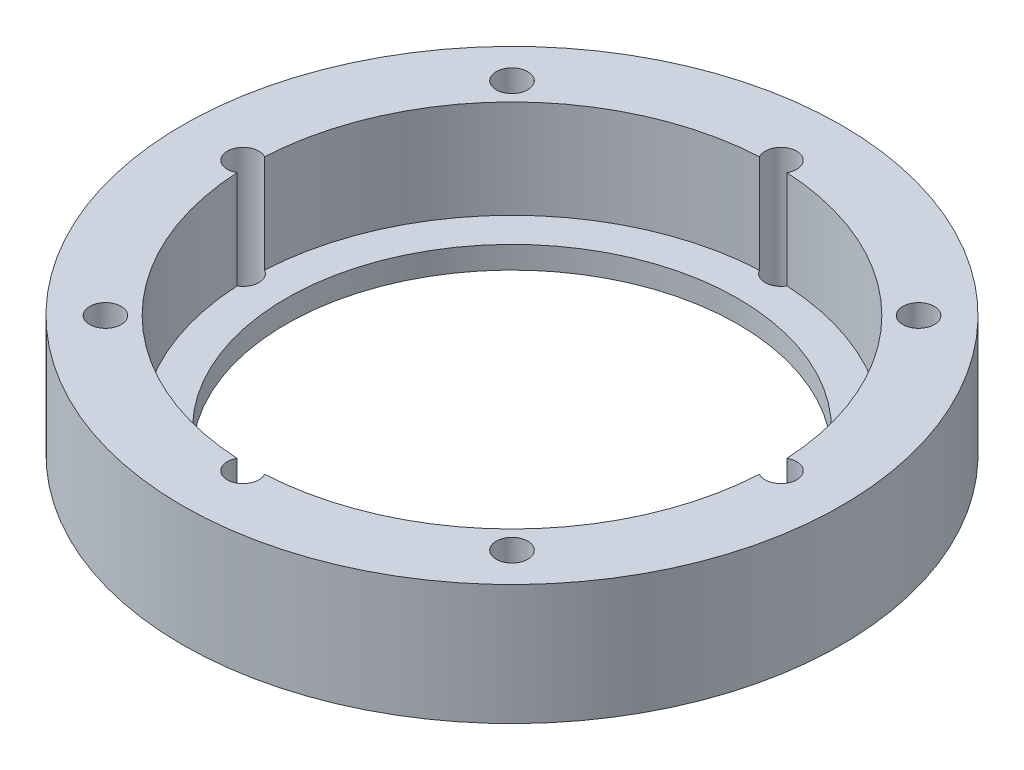
ISO-10303-21;
HEADER;
FILE_DESCRIPTION(('STEP AP214'),'2;1');
FILE_NAME('part.step','',(''),(''),'','','');
FILE_SCHEMA(('AUTOMOTIVE_DESIGN { 1 0 10303 214 1 1 1 1 }'));
ENDSEC;
DATA;
#1=APPLICATION_CONTEXT('core data for automotive mechanical design processes');
#2=APPLICATION_PROTOCOL_DEFINITION('international standard','automotive_design',2000,#1);
#3=PRODUCT_CONTEXT('',#1,'mechanical');
#4=PRODUCT('Part','Part','',(#3));
#5=PRODUCT_RELATED_PRODUCT_CATEGORY('part','',(#4));
#6=PRODUCT_DEFINITION_FORMATION('','',#4);
#7=PRODUCT_DEFINITION_CONTEXT('part definition',#1,'design');
#8=PRODUCT_DEFINITION('design','',#6,#7);
#9=PRODUCT_DEFINITION_SHAPE('','',#8);
#10=(LENGTH_UNIT() NAMED_UNIT(*) SI_UNIT(.MILLI.,.METRE.));
#11=(NAMED_UNIT(*) PLANE_ANGLE_UNIT() SI_UNIT($,.RADIAN.));
#12=(NAMED_UNIT(*) SI_UNIT($,.STERADIAN.) SOLID_ANGLE_UNIT());
#13=UNCERTAINTY_MEASURE_WITH_UNIT(LENGTH_MEASURE(1.E-05),#10,'distance_accuracy_value','');
#14=(GEOMETRIC_REPRESENTATION_CONTEXT(3) GLOBAL_UNCERTAINTY_ASSIGNED_CONTEXT((#13)) GLOBAL_UNIT_ASSIGNED_CONTEXT((#10,
#11,#12)) REPRESENTATION_CONTEXT('',''));
#15=CARTESIAN_POINT('',(0.,0.,0.));
#16=DIRECTION('',(0.,0.,1.));
#17=DIRECTION('',(1.,0.,0.));
#18=AXIS2_PLACEMENT_3D('',#15,#16,#17);
#19=CARTESIAN_POINT('',(0.,0.,0.));
#20=DIRECTION('',(0.,-1.,0.));
#21=DIRECTION('',(0.,0.,-1.));
#22=AXIS2_PLACEMENT_3D('',#19,#20,#21);
#23=CYLINDRICAL_SURFACE('',#22,18.65);
#24=CARTESIAN_POINT('',(0.,8.5875,0.));
#25=DIRECTION('',(0.,-1.,0.));
#26=DIRECTION('',(0.,0.,-1.));
#27=AXIS2_PLACEMENT_3D('',#24,#25,#26);
#28=CIRCLE('',#27,18.65);
#29=CARTESIAN_POINT('',(0.979838942086625,8.5875,-18.6242426865516));
#30=VERTEX_POINT('',#29);
#31=CARTESIAN_POINT('',(18.6242426865516,8.5875,-0.97983894208656));
#32=VERTEX_POINT('',#31);
#33=EDGE_CURVE('E124',#30,#32,#28,.T.);
#34=ORIENTED_EDGE('',*,*,#33,.F.);
#35=DIRECTION('',(0.,-1.,0.));
#36=VECTOR('',#35,1.);
#37=CARTESIAN_POINT('',(0.979838942086616,4.29375,-18.6242426865516));
#38=LINE('',#37,#36);
#39=CARTESIAN_POINT('',(0.97983894208658,1.5875,-18.6242426865516));
#40=VERTEX_POINT('',#39);
#41=EDGE_CURVE('E138',#30,#40,#38,.T.);
#42=ORIENTED_EDGE('',*,*,#41,.T.);
#43=CARTESIAN_POINT('',(0.,1.5875,0.));
#44=DIRECTION('',(0.,-1.,0.));
#45=DIRECTION('',(0.,0.,-1.));
#46=AXIS2_PLACEMENT_3D('',#43,#44,#45);
#47=CIRCLE('',#46,18.65);
#48=CARTESIAN_POINT('',(18.6242426865516,1.5875,-0.979838942086515));
#49=VERTEX_POINT('',#48);
#50=EDGE_CURVE('E126',#40,#49,#47,.T.);
#51=ORIENTED_EDGE('',*,*,#50,.T.);
#52=DIRECTION('',(0.,-1.,0.));
#53=VECTOR('',#52,1.);
#54=CARTESIAN_POINT('',(18.6242426865516,4.29375,-0.97983894208655));
#55=LINE('',#54,#53);
#56=EDGE_CURVE('E56',#49,#32,#55,.F.);
#57=ORIENTED_EDGE('',*,*,#56,.T.);
#58=EDGE_LOOP('',(#34,#42,#51,#57));
#59=FACE_BOUND('',#58,.T.);
#60=ADVANCED_FACE('F33',(#59),#23,.F.);
#61=CARTESIAN_POINT('',(18.6242426865516,8.5875,0.97983894208656));
#62=VERTEX_POINT('',#61);
#63=CARTESIAN_POINT('',(0.979838942086365,8.5875,18.6242426865516));
#64=VERTEX_POINT('',#63);
#65=EDGE_CURVE('E115',#62,#64,#28,.T.);
#66=ORIENTED_EDGE('',*,*,#65,.F.);
#67=DIRECTION('',(0.,-1.,0.));
#68=VECTOR('',#67,1.);
#69=CARTESIAN_POINT('',(18.6242426865516,4.29375,0.979838942086549));
#70=LINE('',#69,#68);
#71=CARTESIAN_POINT('',(18.6242426865516,1.5875,0.979838942086515));
#72=VERTEX_POINT('',#71);
#73=EDGE_CURVE('E140',#62,#72,#70,.T.);
#74=ORIENTED_EDGE('',*,*,#73,.T.);
#75=CARTESIAN_POINT('',(0.97983894208632,1.5875,18.6242426865516));
#76=VERTEX_POINT('',#75);
#77=EDGE_CURVE('E181',#72,#76,#47,.T.);
#78=ORIENTED_EDGE('',*,*,#77,.T.);
#79=DIRECTION('',(0.,-1.,0.));
#80=VECTOR('',#79,1.);
#81=CARTESIAN_POINT('',(0.979838942086355,4.29375,18.6242426865516));
#82=LINE('',#81,#80);
#83=EDGE_CURVE('E48',#76,#64,#82,.F.);
#84=ORIENTED_EDGE('',*,*,#83,.T.);
#85=EDGE_LOOP('',(#66,#74,#78,#84));
#86=FACE_BOUND('',#85,.T.);
#87=ADVANCED_FACE('F185',(#86),#23,.F.);
#88=CARTESIAN_POINT('',(-0.979838942086755,8.5875,18.6242426865516));
#89=VERTEX_POINT('',#88);
#90=CARTESIAN_POINT('',(-18.6242426865516,8.5875,0.97983894208656));
#91=VERTEX_POINT('',#90);
#92=EDGE_CURVE('E111',#89,#91,#28,.T.);
#93=ORIENTED_EDGE('',*,*,#92,.F.);
#94=DIRECTION('',(0.,-1.,0.));
#95=VECTOR('',#94,1.);
#96=CARTESIAN_POINT('',(-0.979838942086745,4.29375,18.6242426865516));
#97=LINE('',#96,#95);
#98=CARTESIAN_POINT('',(-0.97983894208671,1.5875,18.6242426865516));
#99=VERTEX_POINT('',#98);
#100=EDGE_CURVE('E96',#89,#99,#97,.T.);
#101=ORIENTED_EDGE('',*,*,#100,.T.);
#102=CARTESIAN_POINT('',(-18.6242426865516,1.5875,0.979838942086515));
#103=VERTEX_POINT('',#102);
#104=EDGE_CURVE('E128',#99,#103,#47,.T.);
#105=ORIENTED_EDGE('',*,*,#104,.T.);
#106=DIRECTION('',(0.,-1.,0.));
#107=VECTOR('',#106,1.);
#108=CARTESIAN_POINT('',(-18.6242426865516,4.29375,0.97983894208655));
#109=LINE('',#108,#107);
#110=EDGE_CURVE('E122',#103,#91,#109,.F.);
#111=ORIENTED_EDGE('',*,*,#110,.T.);
#112=EDGE_LOOP('',(#93,#101,#105,#111));
#113=FACE_BOUND('',#112,.T.);
#114=ADVANCED_FACE('F120',(#113),#23,.F.);
#115=CARTESIAN_POINT('',(0.,0.,0.));
#116=DIRECTION('',(0.,-1.,0.));
#117=DIRECTION('',(0.,0.,-1.));
#118=AXIS2_PLACEMENT_3D('',#115,#116,#117);
#119=CYLINDRICAL_SURFACE('',#118,23.5);
#120=CARTESIAN_POINT('',(0.,0.,0.));
#121=DIRECTION('',(0.,-1.,0.));
#122=DIRECTION('',(0.,0.,-1.));
#123=AXIS2_PLACEMENT_3D('',#120,#121,#122);
#124=CIRCLE('',#123,23.5);
#125=CARTESIAN_POINT('',(0.,0.,-23.5));
#126=VERTEX_POINT('',#125);
#127=EDGE_CURVE('E171',#126,#126,#124,.T.);
#128=ORIENTED_EDGE('',*,*,#127,.F.);
#129=EDGE_LOOP('',(#128));
#130=FACE_BOUND('',#129,.T.);
#131=CARTESIAN_POINT('',(0.,8.5875,0.));
#132=DIRECTION('',(0.,-1.,0.));
#133=DIRECTION('',(0.,0.,-1.));
#134=AXIS2_PLACEMENT_3D('',#131,#132,#133);
#135=CIRCLE('',#134,23.5);
#136=CARTESIAN_POINT('',(0.,8.5875,-23.5));
#137=VERTEX_POINT('',#136);
#138=EDGE_CURVE('E11',#137,#137,#135,.T.);
#139=ORIENTED_EDGE('',*,*,#138,.T.);
#140=EDGE_LOOP('',(#139));
#141=FACE_BOUND('',#140,.T.);
#142=ADVANCED_FACE('F35',(#130,#141),#119,.T.);
#143=CARTESIAN_POINT('',(-23.5,8.5875,0.));
#144=DIRECTION('',(0.,-1.,0.));
#145=DIRECTION('',(0.,0.,-1.));
#146=AXIS2_PLACEMENT_3D('',#143,#144,#145);
#147=PLANE('',#146);
#148=CARTESIAN_POINT('',(-14.4956890291734,8.5875,-14.4956890291735));
#149=DIRECTION('',(0.,-1.,0.));
#150=DIRECTION('',(1.,0.,0.));
#151=AXIS2_PLACEMENT_3D('',#148,#149,#150);
#152=CIRCLE('',#151,1.125);
#153=CARTESIAN_POINT('',(-13.3706890291734,8.5875,-14.4956890291735));
#154=VERTEX_POINT('',#153);
#155=EDGE_CURVE('E194',#154,#154,#152,.T.);
#156=ORIENTED_EDGE('',*,*,#155,.T.);
#157=EDGE_LOOP('',(#156));
#158=FACE_BOUND('',#157,.T.);
#159=CARTESIAN_POINT('',(14.4956890291735,8.5875,-14.4956890291735));
#160=DIRECTION('',(0.,-1.,0.));
#161=DIRECTION('',(0.,0.,1.));
#162=AXIS2_PLACEMENT_3D('',#159,#160,#161);
#163=CIRCLE('',#162,1.125);
#164=CARTESIAN_POINT('',(14.4956890291735,8.5875,-13.3706890291735));
#165=VERTEX_POINT('',#164);
#166=EDGE_CURVE('E210',#165,#165,#163,.T.);
#167=ORIENTED_EDGE('',*,*,#166,.T.);
#168=EDGE_LOOP('',(#167));
#169=FACE_BOUND('',#168,.T.);
#170=CARTESIAN_POINT('',(14.4956890291733,8.5875,14.4956890291736));
#171=DIRECTION('',(0.,-1.,0.));
#172=DIRECTION('',(-1.,0.,0.));
#173=AXIS2_PLACEMENT_3D('',#170,#171,#172);
#174=CIRCLE('',#173,1.125);
#175=CARTESIAN_POINT('',(13.3706890291733,8.5875,14.4956890291736));
#176=VERTEX_POINT('',#175);
#177=EDGE_CURVE('E204',#176,#176,#174,.T.);
#178=ORIENTED_EDGE('',*,*,#177,.T.);
#179=EDGE_LOOP('',(#178));
#180=FACE_BOUND('',#179,.T.);
#181=CARTESIAN_POINT('',(-14.4956890291735,8.5875,14.4956890291735));
#182=DIRECTION('',(0.,-1.,0.));
#183=DIRECTION('',(0.,0.,-1.));
#184=AXIS2_PLACEMENT_3D('',#181,#182,#183);
#185=CIRCLE('',#184,1.125);
#186=CARTESIAN_POINT('',(-14.4956890291735,8.5875,13.3706890291735));
#187=VERTEX_POINT('',#186);
#188=EDGE_CURVE('E154',#187,#187,#185,.T.);
#189=ORIENTED_EDGE('',*,*,#188,.T.);
#190=EDGE_LOOP('',(#189));
#191=FACE_BOUND('',#190,.T.);
#192=ORIENTED_EDGE('',*,*,#138,.F.);
#193=EDGE_LOOP('',(#192));
#194=FACE_BOUND('',#193,.T.);
#195=CARTESIAN_POINT('',(-18.6242426865516,8.5875,-0.97983894208656));
#196=VERTEX_POINT('',#195);
#197=CARTESIAN_POINT('',(-0.979838942086495,8.5875,-18.6242426865516));
#198=VERTEX_POINT('',#197);
#199=EDGE_CURVE('E41',#196,#198,#28,.T.);
#200=ORIENTED_EDGE('',*,*,#199,.T.);
#201=CARTESIAN_POINT('',(0.,8.5875,-19.177));
#202=DIRECTION('',(0.,-1.,0.));
#203=DIRECTION('',(1.,0.,0.));
#204=AXIS2_PLACEMENT_3D('',#201,#202,#203);
#205=CIRCLE('',#204,1.125);
#206=EDGE_CURVE('E134',#198,#30,#205,.T.);
#207=ORIENTED_EDGE('',*,*,#206,.T.);
#208=ORIENTED_EDGE('',*,*,#33,.T.);
#209=CARTESIAN_POINT('',(19.177,8.5875,0.));
#210=DIRECTION('',(0.,-1.,0.));
#211=DIRECTION('',(0.,0.,1.));
#212=AXIS2_PLACEMENT_3D('',#209,#210,#211);
#213=CIRCLE('',#212,1.125);
#214=EDGE_CURVE('E133',#32,#62,#213,.T.);
#215=ORIENTED_EDGE('',*,*,#214,.T.);
#216=ORIENTED_EDGE('',*,*,#65,.T.);
#217=CARTESIAN_POINT('',(-2.00749121284926E-13,8.5875,19.177));
#218=DIRECTION('',(0.,-1.,0.));
#219=DIRECTION('',(-1.,0.,0.));
#220=AXIS2_PLACEMENT_3D('',#217,#218,#219);
#221=CIRCLE('',#220,1.125);
#222=EDGE_CURVE('E99',#64,#89,#221,.T.);
#223=ORIENTED_EDGE('',*,*,#222,.T.);
#224=ORIENTED_EDGE('',*,*,#92,.T.);
#225=CARTESIAN_POINT('',(-19.177,8.5875,0.));
#226=DIRECTION('',(0.,-1.,0.));
#227=DIRECTION('',(0.,0.,-1.));
#228=AXIS2_PLACEMENT_3D('',#225,#226,#227);
#229=CIRCLE('',#228,1.125);
#230=EDGE_CURVE('E160',#91,#196,#229,.T.);
#231=ORIENTED_EDGE('',*,*,#230,.T.);
#232=EDGE_LOOP('',(#200,#207,#208,#215,#216,#223,#224,#231));
#233=FACE_BOUND('',#232,.T.);
#234=ADVANCED_FACE('F109',(#158,#169,#180,#191,#194,#233),#147,.F.);
#235=CARTESIAN_POINT('',(-18.6242426865516,1.5875,-0.979838942086515));
#236=VERTEX_POINT('',#235);
#237=CARTESIAN_POINT('',(-0.97983894208645,1.5875,-18.6242426865516));
#238=VERTEX_POINT('',#237);
#239=EDGE_CURVE('E123',#236,#238,#47,.T.);
#240=ORIENTED_EDGE('',*,*,#239,.T.);
#241=DIRECTION('',(0.,-1.,0.));
#242=VECTOR('',#241,1.);
#243=CARTESIAN_POINT('',(-0.979838942086485,4.29375,-18.6242426865516));
#244=LINE('',#243,#242);
#245=EDGE_CURVE('E149',#238,#198,#244,.F.);
#246=ORIENTED_EDGE('',*,*,#245,.T.);
#247=ORIENTED_EDGE('',*,*,#199,.F.);
#248=DIRECTION('',(0.,-1.,0.));
#249=VECTOR('',#248,1.);
#250=CARTESIAN_POINT('',(-18.6242426865516,4.29375,-0.979838942086549));
#251=LINE('',#250,#249);
#252=EDGE_CURVE('E168',#196,#236,#251,.T.);
#253=ORIENTED_EDGE('',*,*,#252,.T.);
#254=EDGE_LOOP('',(#240,#246,#247,#253));
#255=FACE_BOUND('',#254,.T.);
#256=ADVANCED_FACE('F257',(#255),#23,.F.);
#257=CARTESIAN_POINT('',(-18.65,1.5875,0.));
#258=DIRECTION('',(0.,-1.,0.));
#259=DIRECTION('',(0.,0.,-1.));
#260=AXIS2_PLACEMENT_3D('',#257,#258,#259);
#261=PLANE('',#260);
#262=ORIENTED_EDGE('',*,*,#50,.F.);
#263=CARTESIAN_POINT('',(0.,1.5875,-19.177));
#264=DIRECTION('',(0.,-1.,0.));
#265=DIRECTION('',(0.,0.,-1.));
#266=AXIS2_PLACEMENT_3D('',#263,#264,#265);
#267=CIRCLE('',#266,1.125);
#268=EDGE_CURVE('E143',#40,#238,#267,.T.);
#269=ORIENTED_EDGE('',*,*,#268,.T.);
#270=ORIENTED_EDGE('',*,*,#239,.F.);
#271=CARTESIAN_POINT('',(-19.177,1.5875,0.));
#272=DIRECTION('',(0.,-1.,0.));
#273=DIRECTION('',(0.,0.,-1.));
#274=AXIS2_PLACEMENT_3D('',#271,#272,#273);
#275=CIRCLE('',#274,1.125);
#276=EDGE_CURVE('E162',#236,#103,#275,.T.);
#277=ORIENTED_EDGE('',*,*,#276,.T.);
#278=ORIENTED_EDGE('',*,*,#104,.F.);
#279=CARTESIAN_POINT('',(-2.00749121284926E-13,1.5875,19.177));
#280=DIRECTION('',(0.,-1.,0.));
#281=DIRECTION('',(0.,0.,-1.));
#282=AXIS2_PLACEMENT_3D('',#279,#280,#281);
#283=CIRCLE('',#282,1.125);
#284=EDGE_CURVE('E100',#99,#76,#283,.T.);
#285=ORIENTED_EDGE('',*,*,#284,.T.);
#286=ORIENTED_EDGE('',*,*,#77,.F.);
#287=CARTESIAN_POINT('',(19.177,1.5875,0.));
#288=DIRECTION('',(0.,-1.,0.));
#289=DIRECTION('',(0.,0.,-1.));
#290=AXIS2_PLACEMENT_3D('',#287,#288,#289);
#291=CIRCLE('',#290,1.125);
#292=EDGE_CURVE('E104',#72,#49,#291,.T.);
#293=ORIENTED_EDGE('',*,*,#292,.T.);
#294=EDGE_LOOP('',(#262,#269,#270,#277,#278,#285,#286,#293));
#295=FACE_BOUND('',#294,.T.);
#296=CARTESIAN_POINT('',(0.,1.5875,0.));
#297=DIRECTION('',(0.,-1.,0.));
#298=DIRECTION('',(0.,0.,-1.));
#299=AXIS2_PLACEMENT_3D('',#296,#297,#298);
#300=CIRCLE('',#299,16.11);
#301=CARTESIAN_POINT('',(0.,1.5875,-16.11));
#302=VERTEX_POINT('',#301);
#303=EDGE_CURVE('E177',#302,#302,#300,.T.);
#304=ORIENTED_EDGE('',*,*,#303,.T.);
#305=EDGE_LOOP('',(#304));
#306=FACE_BOUND('',#305,.T.);
#307=ADVANCED_FACE('F187',(#295,#306),#261,.F.);
#308=CARTESIAN_POINT('',(0.,0.,0.));
#309=DIRECTION('',(0.,-1.,0.));
#310=DIRECTION('',(0.,0.,-1.));
#311=AXIS2_PLACEMENT_3D('',#308,#309,#310);
#312=CYLINDRICAL_SURFACE('',#311,16.11);
#313=ORIENTED_EDGE('',*,*,#303,.F.);
#314=EDGE_LOOP('',(#313));
#315=FACE_BOUND('',#314,.T.);
#316=CARTESIAN_POINT('',(0.,0.,0.));
#317=DIRECTION('',(0.,-1.,0.));
#318=DIRECTION('',(0.,0.,-1.));
#319=AXIS2_PLACEMENT_3D('',#316,#317,#318);
#320=CIRCLE('',#319,16.11);
#321=CARTESIAN_POINT('',(0.,0.,-16.11));
#322=VERTEX_POINT('',#321);
#323=EDGE_CURVE('E174',#322,#322,#320,.T.);
#324=ORIENTED_EDGE('',*,*,#323,.T.);
#325=EDGE_LOOP('',(#324));
#326=FACE_BOUND('',#325,.T.);
#327=ADVANCED_FACE('F232',(#315,#326),#312,.F.);
#328=CARTESIAN_POINT('',(-16.11,0.,0.));
#329=DIRECTION('',(0.,1.,0.));
#330=DIRECTION('',(0.,0.,1.));
#331=AXIS2_PLACEMENT_3D('',#328,#329,#330);
#332=PLANE('',#331);
#333=CARTESIAN_POINT('',(-14.4956890291734,0.,-14.4956890291735));
#334=DIRECTION('',(0.,-1.,0.));
#335=DIRECTION('',(1.,0.,0.));
#336=AXIS2_PLACEMENT_3D('',#333,#334,#335);
#337=CIRCLE('',#336,1.125);
#338=CARTESIAN_POINT('',(-13.3706890291734,0.,-14.4956890291735));
#339=VERTEX_POINT('',#338);
#340=EDGE_CURVE('E213',#339,#339,#337,.T.);
#341=ORIENTED_EDGE('',*,*,#340,.F.);
#342=EDGE_LOOP('',(#341));
#343=FACE_BOUND('',#342,.T.);
#344=CARTESIAN_POINT('',(14.4956890291735,0.,-14.4956890291735));
#345=DIRECTION('',(0.,-1.,0.));
#346=DIRECTION('',(0.,0.,1.));
#347=AXIS2_PLACEMENT_3D('',#344,#345,#346);
#348=CIRCLE('',#347,1.125);
#349=CARTESIAN_POINT('',(14.4956890291735,0.,-13.3706890291735));
#350=VERTEX_POINT('',#349);
#351=EDGE_CURVE('E207',#350,#350,#348,.T.);
#352=ORIENTED_EDGE('',*,*,#351,.F.);
#353=EDGE_LOOP('',(#352));
#354=FACE_BOUND('',#353,.T.);
#355=CARTESIAN_POINT('',(14.4956890291733,0.,14.4956890291736));
#356=DIRECTION('',(0.,-1.,0.));
#357=DIRECTION('',(-1.,0.,0.));
#358=AXIS2_PLACEMENT_3D('',#355,#356,#357);
#359=CIRCLE('',#358,1.125);
#360=CARTESIAN_POINT('',(13.3706890291733,0.,14.4956890291736));
#361=VERTEX_POINT('',#360);
#362=EDGE_CURVE('E201',#361,#361,#359,.T.);
#363=ORIENTED_EDGE('',*,*,#362,.F.);
#364=EDGE_LOOP('',(#363));
#365=FACE_BOUND('',#364,.T.);
#366=CARTESIAN_POINT('',(0.,0.,-19.177));
#367=DIRECTION('',(0.,-1.,0.));
#368=DIRECTION('',(1.,0.,0.));
#369=AXIS2_PLACEMENT_3D('',#366,#367,#368);
#370=CIRCLE('',#369,1.125);
#371=CARTESIAN_POINT('',(1.12500000000007,0.,-19.177));
#372=VERTEX_POINT('',#371);
#373=EDGE_CURVE('E190',#372,#372,#370,.T.);
#374=ORIENTED_EDGE('',*,*,#373,.F.);
#375=EDGE_LOOP('',(#374));
#376=FACE_BOUND('',#375,.T.);
#377=CARTESIAN_POINT('',(19.177,0.,0.));
#378=DIRECTION('',(0.,-1.,0.));
#379=DIRECTION('',(0.,0.,1.));
#380=AXIS2_PLACEMENT_3D('',#377,#378,#379);
#381=CIRCLE('',#380,1.125);
#382=CARTESIAN_POINT('',(19.177,0.,1.125));
#383=VERTEX_POINT('',#382);
#384=EDGE_CURVE('E116',#383,#383,#381,.T.);
#385=ORIENTED_EDGE('',*,*,#384,.F.);
#386=EDGE_LOOP('',(#385));
#387=FACE_BOUND('',#386,.T.);
#388=CARTESIAN_POINT('',(-2.00749121284926E-13,0.,19.177));
#389=DIRECTION('',(0.,-1.,0.));
#390=DIRECTION('',(-1.,0.,0.));
#391=AXIS2_PLACEMENT_3D('',#388,#389,#390);
#392=CIRCLE('',#391,1.125);
#393=CARTESIAN_POINT('',(-1.1250000000002,0.,19.177));
#394=VERTEX_POINT('',#393);
#395=EDGE_CURVE('E117',#394,#394,#392,.T.);
#396=ORIENTED_EDGE('',*,*,#395,.F.);
#397=EDGE_LOOP('',(#396));
#398=FACE_BOUND('',#397,.T.);
#399=CARTESIAN_POINT('',(-14.4956890291735,0.,14.4956890291735));
#400=DIRECTION('',(0.,-1.,0.));
#401=DIRECTION('',(0.,0.,-1.));
#402=AXIS2_PLACEMENT_3D('',#399,#400,#401);
#403=CIRCLE('',#402,1.125);
#404=CARTESIAN_POINT('',(-14.4956890291735,0.,13.3706890291735));
#405=VERTEX_POINT('',#404);
#406=EDGE_CURVE('E153',#405,#405,#403,.T.);
#407=ORIENTED_EDGE('',*,*,#406,.F.);
#408=EDGE_LOOP('',(#407));
#409=FACE_BOUND('',#408,.T.);
#410=CARTESIAN_POINT('',(-19.177,0.,0.));
#411=DIRECTION('',(0.,-1.,0.));
#412=DIRECTION('',(0.,0.,-1.));
#413=AXIS2_PLACEMENT_3D('',#410,#411,#412);
#414=CIRCLE('',#413,1.125);
#415=CARTESIAN_POINT('',(-19.177,0.,-1.125));
#416=VERTEX_POINT('',#415);
#417=EDGE_CURVE('E157',#416,#416,#414,.T.);
#418=ORIENTED_EDGE('',*,*,#417,.F.);
#419=EDGE_LOOP('',(#418));
#420=FACE_BOUND('',#419,.T.);
#421=ORIENTED_EDGE('',*,*,#323,.F.);
#422=EDGE_LOOP('',(#421));
#423=FACE_BOUND('',#422,.T.);
#424=ORIENTED_EDGE('',*,*,#127,.T.);
#425=EDGE_LOOP('',(#424));
#426=FACE_BOUND('',#425,.T.);
#427=ADVANCED_FACE('F228',(#343,#354,#365,#376,#387,#398,#409,#420,#423,#426),#332,.F.);
#428=CARTESIAN_POINT('',(-19.177,8.5875,0.));
#429=DIRECTION('',(0.,-1.,0.));
#430=DIRECTION('',(0.,0.,-1.));
#431=AXIS2_PLACEMENT_3D('',#428,#429,#430);
#432=CYLINDRICAL_SURFACE('',#431,1.125);
#433=ORIENTED_EDGE('',*,*,#417,.T.);
#434=EDGE_LOOP('',(#433));
#435=FACE_BOUND('',#434,.T.);
#436=ORIENTED_EDGE('',*,*,#230,.F.);
#437=ORIENTED_EDGE('',*,*,#110,.F.);
#438=ORIENTED_EDGE('',*,*,#276,.F.);
#439=ORIENTED_EDGE('',*,*,#252,.F.);
#440=EDGE_LOOP('',(#436,#437,#438,#439));
#441=FACE_BOUND('',#440,.T.);
#442=ADVANCED_FACE('F231',(#435,#441),#432,.F.);
#443=CARTESIAN_POINT('',(-14.4956890291735,8.5875,14.4956890291735));
#444=DIRECTION('',(0.,-1.,0.));
#445=DIRECTION('',(0.,0.,-1.));
#446=AXIS2_PLACEMENT_3D('',#443,#444,#445);
#447=CYLINDRICAL_SURFACE('',#446,1.125);
#448=ORIENTED_EDGE('',*,*,#188,.F.);
#449=EDGE_LOOP('',(#448));
#450=FACE_BOUND('',#449,.T.);
#451=ORIENTED_EDGE('',*,*,#406,.T.);
#452=EDGE_LOOP('',(#451));
#453=FACE_BOUND('',#452,.T.);
#454=ADVANCED_FACE('F275',(#450,#453),#447,.F.);
#455=CARTESIAN_POINT('',(-2.00749121284926E-13,8.5875,19.177));
#456=DIRECTION('',(0.,-1.,0.));
#457=DIRECTION('',(0.,0.,-1.));
#458=AXIS2_PLACEMENT_3D('',#455,#456,#457);
#459=CYLINDRICAL_SURFACE('',#458,1.125);
#460=ORIENTED_EDGE('',*,*,#395,.T.);
#461=EDGE_LOOP('',(#460));
#462=FACE_BOUND('',#461,.T.);
#463=ORIENTED_EDGE('',*,*,#222,.F.);
#464=ORIENTED_EDGE('',*,*,#83,.F.);
#465=ORIENTED_EDGE('',*,*,#284,.F.);
#466=ORIENTED_EDGE('',*,*,#100,.F.);
#467=EDGE_LOOP('',(#463,#464,#465,#466));
#468=FACE_BOUND('',#467,.T.);
#469=ADVANCED_FACE('F98',(#462,#468),#459,.F.);
#470=CARTESIAN_POINT('',(19.177,8.5875,0.));
#471=DIRECTION('',(0.,-1.,0.));
#472=DIRECTION('',(0.,0.,-1.));
#473=AXIS2_PLACEMENT_3D('',#470,#471,#472);
#474=CYLINDRICAL_SURFACE('',#473,1.125);
#475=ORIENTED_EDGE('',*,*,#384,.T.);
#476=EDGE_LOOP('',(#475));
#477=FACE_BOUND('',#476,.T.);
#478=ORIENTED_EDGE('',*,*,#214,.F.);
#479=ORIENTED_EDGE('',*,*,#56,.F.);
#480=ORIENTED_EDGE('',*,*,#292,.F.);
#481=ORIENTED_EDGE('',*,*,#73,.F.);
#482=EDGE_LOOP('',(#478,#479,#480,#481));
#483=FACE_BOUND('',#482,.T.);
#484=ADVANCED_FACE('F282',(#477,#483),#474,.F.);
#485=CARTESIAN_POINT('',(0.,8.5875,-19.177));
#486=DIRECTION('',(0.,-1.,0.));
#487=DIRECTION('',(0.,0.,-1.));
#488=AXIS2_PLACEMENT_3D('',#485,#486,#487);
#489=CYLINDRICAL_SURFACE('',#488,1.125);
#490=ORIENTED_EDGE('',*,*,#373,.T.);
#491=EDGE_LOOP('',(#490));
#492=FACE_BOUND('',#491,.T.);
#493=ORIENTED_EDGE('',*,*,#206,.F.);
#494=ORIENTED_EDGE('',*,*,#245,.F.);
#495=ORIENTED_EDGE('',*,*,#268,.F.);
#496=ORIENTED_EDGE('',*,*,#41,.F.);
#497=EDGE_LOOP('',(#493,#494,#495,#496));
#498=FACE_BOUND('',#497,.T.);
#499=ADVANCED_FACE('F286',(#492,#498),#489,.F.);
#500=CARTESIAN_POINT('',(14.4956890291733,8.5875,14.4956890291736));
#501=DIRECTION('',(0.,-1.,0.));
#502=DIRECTION('',(0.,0.,-1.));
#503=AXIS2_PLACEMENT_3D('',#500,#501,#502);
#504=CYLINDRICAL_SURFACE('',#503,1.125);
#505=ORIENTED_EDGE('',*,*,#177,.F.);
#506=EDGE_LOOP('',(#505));
#507=FACE_BOUND('',#506,.T.);
#508=ORIENTED_EDGE('',*,*,#362,.T.);
#509=EDGE_LOOP('',(#508));
#510=FACE_BOUND('',#509,.T.);
#511=ADVANCED_FACE('F290',(#507,#510),#504,.F.);
#512=CARTESIAN_POINT('',(14.4956890291735,8.5875,-14.4956890291735));
#513=DIRECTION('',(0.,-1.,0.));
#514=DIRECTION('',(0.,0.,-1.));
#515=AXIS2_PLACEMENT_3D('',#512,#513,#514);
#516=CYLINDRICAL_SURFACE('',#515,1.125);
#517=ORIENTED_EDGE('',*,*,#166,.F.);
#518=EDGE_LOOP('',(#517));
#519=FACE_BOUND('',#518,.T.);
#520=ORIENTED_EDGE('',*,*,#351,.T.);
#521=EDGE_LOOP('',(#520));
#522=FACE_BOUND('',#521,.T.);
#523=ADVANCED_FACE('F224',(#519,#522),#516,.F.);
#524=CARTESIAN_POINT('',(-14.4956890291734,8.5875,-14.4956890291735));
#525=DIRECTION('',(0.,-1.,0.));
#526=DIRECTION('',(0.,0.,-1.));
#527=AXIS2_PLACEMENT_3D('',#524,#525,#526);
#528=CYLINDRICAL_SURFACE('',#527,1.125);
#529=ORIENTED_EDGE('',*,*,#155,.F.);
#530=EDGE_LOOP('',(#529));
#531=FACE_BOUND('',#530,.T.);
#532=ORIENTED_EDGE('',*,*,#340,.T.);
#533=EDGE_LOOP('',(#532));
#534=FACE_BOUND('',#533,.T.);
#535=ADVANCED_FACE('F221',(#531,#534),#528,.F.);
#536=CLOSED_SHELL('',(#60,#87,#114,#142,#234,#256,#307,#327,#427,#442,#454,#469,#484,#499,#511,
#523,#535));
#537=MANIFOLD_SOLID_BREP('B2',#536);
#538=ADVANCED_BREP_SHAPE_REPRESENTATION('',(#18,#537),#14);
#539=SHAPE_DEFINITION_REPRESENTATION(#9,#538);
ENDSEC;
END-ISO-10303-21;
